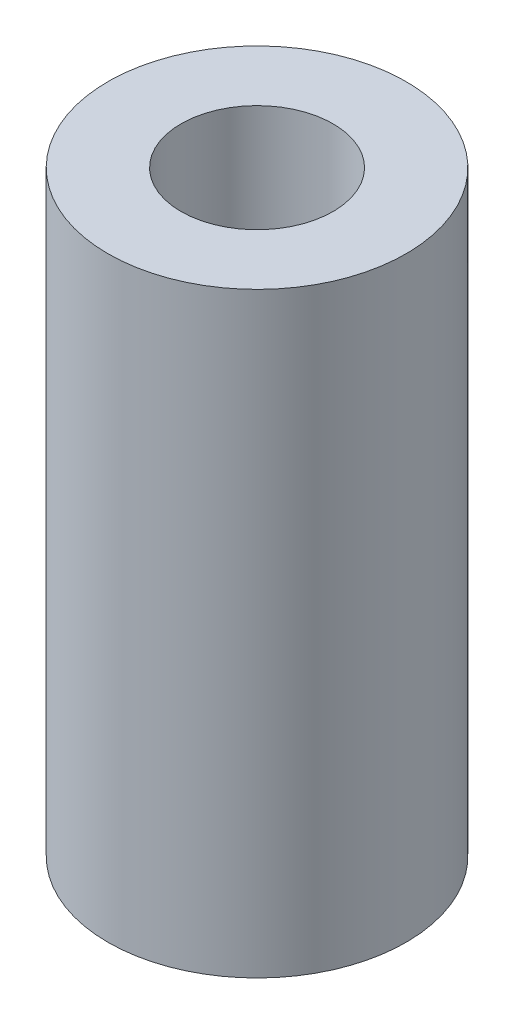
ISO-10303-21;
HEADER;
FILE_DESCRIPTION(('STEP AP214'),'2;1');
FILE_NAME('part.step','',(''),(''),'','','');
FILE_SCHEMA(('AUTOMOTIVE_DESIGN { 1 0 10303 214 1 1 1 1 }'));
ENDSEC;
DATA;
#1=APPLICATION_CONTEXT('core data for automotive mechanical design processes');
#2=APPLICATION_PROTOCOL_DEFINITION('international standard','automotive_design',2000,#1);
#3=PRODUCT_CONTEXT('',#1,'mechanical');
#4=PRODUCT('Part','Part','',(#3));
#5=PRODUCT_RELATED_PRODUCT_CATEGORY('part','',(#4));
#6=PRODUCT_DEFINITION_FORMATION('','',#4);
#7=PRODUCT_DEFINITION_CONTEXT('part definition',#1,'design');
#8=PRODUCT_DEFINITION('design','',#6,#7);
#9=PRODUCT_DEFINITION_SHAPE('','',#8);
#10=(LENGTH_UNIT() NAMED_UNIT(*) SI_UNIT(.MILLI.,.METRE.));
#11=(NAMED_UNIT(*) PLANE_ANGLE_UNIT() SI_UNIT($,.RADIAN.));
#12=(NAMED_UNIT(*) SI_UNIT($,.STERADIAN.) SOLID_ANGLE_UNIT());
#13=UNCERTAINTY_MEASURE_WITH_UNIT(LENGTH_MEASURE(1.E-05),#10,'distance_accuracy_value','');
#14=(GEOMETRIC_REPRESENTATION_CONTEXT(3) GLOBAL_UNCERTAINTY_ASSIGNED_CONTEXT((#13)) GLOBAL_UNIT_ASSIGNED_CONTEXT((#10,
#11,#12)) REPRESENTATION_CONTEXT('',''));
#15=CARTESIAN_POINT('',(0.,0.,0.));
#16=DIRECTION('',(0.,0.,1.));
#17=DIRECTION('',(1.,0.,0.));
#18=AXIS2_PLACEMENT_3D('',#15,#16,#17);
#19=CARTESIAN_POINT('',(0.,25.4,0.));
#20=DIRECTION('',(0.,-1.,0.));
#21=DIRECTION('',(0.,0.,-1.));
#22=AXIS2_PLACEMENT_3D('',#19,#20,#21);
#23=CYLINDRICAL_SURFACE('',#22,6.35);
#24=CARTESIAN_POINT('',(0.,25.4,0.));
#25=DIRECTION('',(0.,1.,0.));
#26=DIRECTION('',(0.,0.,1.));
#27=AXIS2_PLACEMENT_3D('',#24,#25,#26);
#28=CIRCLE('',#27,6.35);
#29=CARTESIAN_POINT('',(0.,25.4,6.35));
#30=VERTEX_POINT('',#29);
#31=EDGE_CURVE('E10',#30,#30,#28,.T.);
#32=ORIENTED_EDGE('',*,*,#31,.F.);
#33=EDGE_LOOP('',(#32));
#34=FACE_BOUND('',#33,.T.);
#35=CARTESIAN_POINT('',(0.,0.,0.));
#36=DIRECTION('',(0.,1.,0.));
#37=DIRECTION('',(0.,0.,1.));
#38=AXIS2_PLACEMENT_3D('',#35,#36,#37);
#39=CIRCLE('',#38,6.35);
#40=CARTESIAN_POINT('',(0.,0.,6.35));
#41=VERTEX_POINT('',#40);
#42=EDGE_CURVE('E36',#41,#41,#39,.T.);
#43=ORIENTED_EDGE('',*,*,#42,.T.);
#44=EDGE_LOOP('',(#43));
#45=FACE_BOUND('',#44,.T.);
#46=ADVANCED_FACE('F33',(#34,#45),#23,.T.);
#47=CARTESIAN_POINT('',(0.,25.4,0.));
#48=DIRECTION('',(0.,1.,0.));
#49=DIRECTION('',(0.,0.,1.));
#50=AXIS2_PLACEMENT_3D('',#47,#48,#49);
#51=PLANE('',#50);
#52=CARTESIAN_POINT('',(0.,25.4,0.));
#53=DIRECTION('',(0.,1.,0.));
#54=DIRECTION('',(0.,0.,1.));
#55=AXIS2_PLACEMENT_3D('',#52,#53,#54);
#56=CIRCLE('',#55,3.2385);
#57=CARTESIAN_POINT('',(0.,25.4,3.2385));
#58=VERTEX_POINT('',#57);
#59=EDGE_CURVE('E51',#58,#58,#56,.T.);
#60=ORIENTED_EDGE('',*,*,#59,.F.);
#61=EDGE_LOOP('',(#60));
#62=FACE_BOUND('',#61,.T.);
#63=ORIENTED_EDGE('',*,*,#31,.T.);
#64=EDGE_LOOP('',(#63));
#65=FACE_BOUND('',#64,.T.);
#66=ADVANCED_FACE('F66',(#62,#65),#51,.T.);
#67=CARTESIAN_POINT('',(0.,0.,0.));
#68=DIRECTION('',(0.,1.,0.));
#69=DIRECTION('',(0.,0.,1.));
#70=AXIS2_PLACEMENT_3D('',#67,#68,#69);
#71=PLANE('',#70);
#72=CARTESIAN_POINT('',(0.,0.,0.));
#73=DIRECTION('',(0.,-1.,0.));
#74=DIRECTION('',(0.,0.,-1.));
#75=AXIS2_PLACEMENT_3D('',#72,#73,#74);
#76=CIRCLE('',#75,3.048);
#77=CARTESIAN_POINT('',(0.,0.,-3.048));
#78=VERTEX_POINT('',#77);
#79=EDGE_CURVE('E45',#78,#78,#76,.T.);
#80=ORIENTED_EDGE('',*,*,#79,.F.);
#81=EDGE_LOOP('',(#80));
#82=FACE_BOUND('',#81,.T.);
#83=ORIENTED_EDGE('',*,*,#42,.F.);
#84=EDGE_LOOP('',(#83));
#85=FACE_BOUND('',#84,.T.);
#86=ADVANCED_FACE('F68',(#82,#85),#71,.F.);
#87=CARTESIAN_POINT('',(0.,8.636,0.));
#88=DIRECTION('',(0.,-1.,0.));
#89=DIRECTION('',(0.,0.,-1.));
#90=AXIS2_PLACEMENT_3D('',#87,#88,#89);
#91=CYLINDRICAL_SURFACE('',#90,3.048);
#92=CARTESIAN_POINT('',(0.,8.636,0.));
#93=DIRECTION('',(0.,-1.,0.));
#94=DIRECTION('',(0.,0.,-1.));
#95=AXIS2_PLACEMENT_3D('',#92,#93,#94);
#96=CIRCLE('',#95,3.048);
#97=CARTESIAN_POINT('',(0.,8.636,-3.048));
#98=VERTEX_POINT('',#97);
#99=EDGE_CURVE('E43',#98,#98,#96,.T.);
#100=ORIENTED_EDGE('',*,*,#99,.F.);
#101=EDGE_LOOP('',(#100));
#102=FACE_BOUND('',#101,.T.);
#103=ORIENTED_EDGE('',*,*,#79,.T.);
#104=EDGE_LOOP('',(#103));
#105=FACE_BOUND('',#104,.T.);
#106=ADVANCED_FACE('F74',(#102,#105),#91,.F.);
#107=CARTESIAN_POINT('',(0.,8.636,0.));
#108=DIRECTION('',(0.,-1.,0.));
#109=DIRECTION('',(0.,0.,-1.));
#110=AXIS2_PLACEMENT_3D('',#107,#108,#109);
#111=PLANE('',#110);
#112=ORIENTED_EDGE('',*,*,#99,.T.);
#113=EDGE_LOOP('',(#112));
#114=FACE_BOUND('',#113,.T.);
#115=ADVANCED_FACE('F62',(#114),#111,.T.);
#116=CARTESIAN_POINT('',(0.,12.7,0.));
#117=DIRECTION('',(0.,1.,0.));
#118=DIRECTION('',(0.,0.,1.));
#119=AXIS2_PLACEMENT_3D('',#116,#117,#118);
#120=CYLINDRICAL_SURFACE('',#119,3.2385);
#121=CARTESIAN_POINT('',(0.,12.7,0.));
#122=DIRECTION('',(0.,1.,0.));
#123=DIRECTION('',(0.,0.,1.));
#124=AXIS2_PLACEMENT_3D('',#121,#122,#123);
#125=CIRCLE('',#124,3.2385);
#126=CARTESIAN_POINT('',(0.,12.7,3.2385));
#127=VERTEX_POINT('',#126);
#128=EDGE_CURVE('E48',#127,#127,#125,.T.);
#129=ORIENTED_EDGE('',*,*,#128,.F.);
#130=EDGE_LOOP('',(#129));
#131=FACE_BOUND('',#130,.T.);
#132=ORIENTED_EDGE('',*,*,#59,.T.);
#133=EDGE_LOOP('',(#132));
#134=FACE_BOUND('',#133,.T.);
#135=ADVANCED_FACE('F59',(#131,#134),#120,.F.);
#136=CARTESIAN_POINT('',(0.,12.7,0.));
#137=DIRECTION('',(0.,1.,0.));
#138=DIRECTION('',(0.,0.,1.));
#139=AXIS2_PLACEMENT_3D('',#136,#137,#138);
#140=PLANE('',#139);
#141=ORIENTED_EDGE('',*,*,#128,.T.);
#142=EDGE_LOOP('',(#141));
#143=FACE_BOUND('',#142,.T.);
#144=ADVANCED_FACE('F57',(#143),#140,.T.);
#145=CLOSED_SHELL('',(#46,#66,#86,#106,#115,#135,#144));
#146=MANIFOLD_SOLID_BREP('B2',#145);
#147=ADVANCED_BREP_SHAPE_REPRESENTATION('',(#18,#146),#14);
#148=SHAPE_DEFINITION_REPRESENTATION(#9,#147);
ENDSEC;
END-ISO-10303-21;
